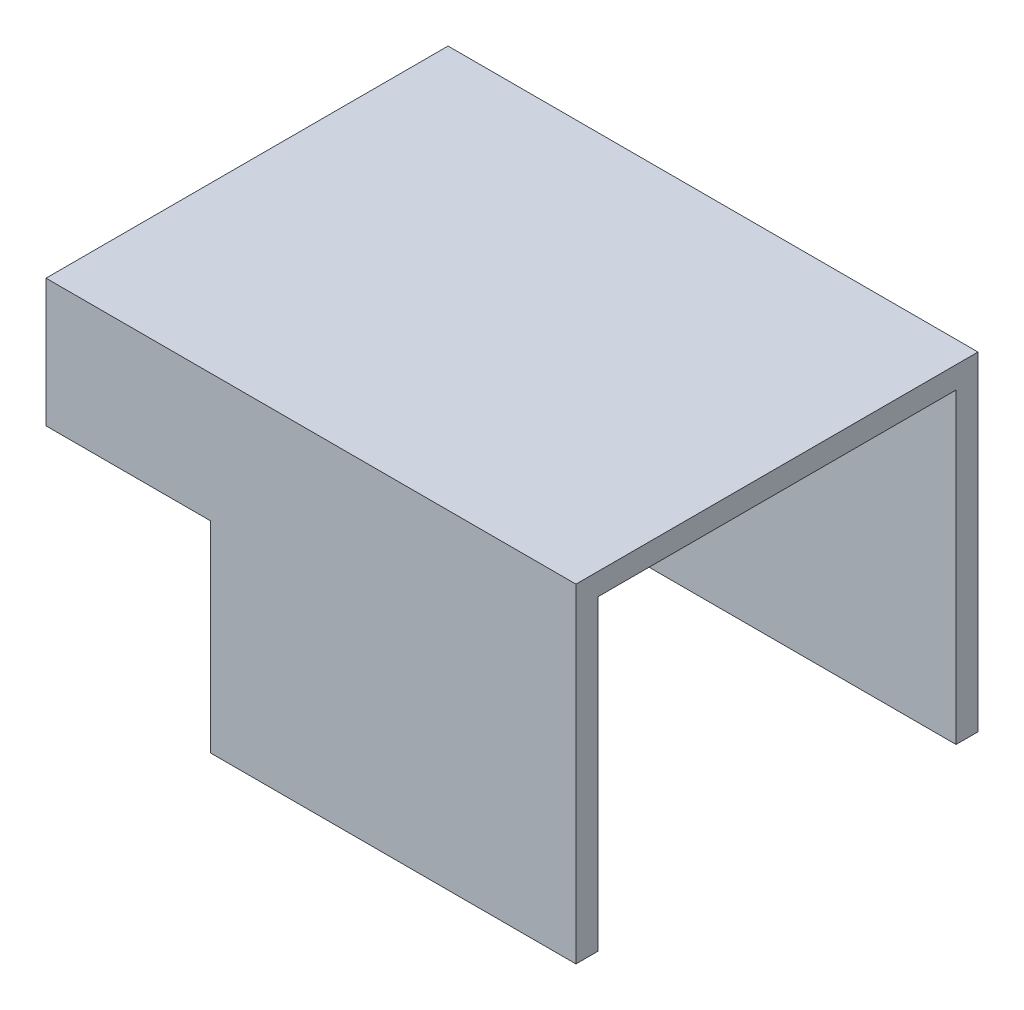
ISO-10303-21;
HEADER;
FILE_DESCRIPTION(('STEP AP214'),'2;1');
FILE_NAME('part.step','',(''),(''),'','','');
FILE_SCHEMA(('AUTOMOTIVE_DESIGN { 1 0 10303 214 1 1 1 1 }'));
ENDSEC;
DATA;
#1=APPLICATION_CONTEXT('core data for automotive mechanical design processes');
#2=APPLICATION_PROTOCOL_DEFINITION('international standard','automotive_design',2000,#1);
#3=PRODUCT_CONTEXT('',#1,'mechanical');
#4=PRODUCT('Part','Part','',(#3));
#5=PRODUCT_RELATED_PRODUCT_CATEGORY('part','',(#4));
#6=PRODUCT_DEFINITION_FORMATION('','',#4);
#7=PRODUCT_DEFINITION_CONTEXT('part definition',#1,'design');
#8=PRODUCT_DEFINITION('design','',#6,#7);
#9=PRODUCT_DEFINITION_SHAPE('','',#8);
#10=(LENGTH_UNIT() NAMED_UNIT(*) SI_UNIT(.MILLI.,.METRE.));
#11=(NAMED_UNIT(*) PLANE_ANGLE_UNIT() SI_UNIT($,.RADIAN.));
#12=(NAMED_UNIT(*) SI_UNIT($,.STERADIAN.) SOLID_ANGLE_UNIT());
#13=UNCERTAINTY_MEASURE_WITH_UNIT(LENGTH_MEASURE(1.E-05),#10,'distance_accuracy_value','');
#14=(GEOMETRIC_REPRESENTATION_CONTEXT(3) GLOBAL_UNCERTAINTY_ASSIGNED_CONTEXT((#13)) GLOBAL_UNIT_ASSIGNED_CONTEXT((#10,
#11,#12)) REPRESENTATION_CONTEXT('',''));
#15=CARTESIAN_POINT('',(0.,0.,0.));
#16=DIRECTION('',(0.,0.,1.));
#17=DIRECTION('',(1.,0.,0.));
#18=AXIS2_PLACEMENT_3D('',#15,#16,#17);
#19=CARTESIAN_POINT('',(0.35,1.695,0.));
#20=DIRECTION('',(0.,1.,0.));
#21=DIRECTION('',(0.707106781186548,0.,0.707106781186548));
#22=AXIS2_PLACEMENT_3D('',#19,#20,#21);
#23=PLANE('',#22);
#24=DIRECTION('',(-1.,0.,0.));
#25=VECTOR('',#24,1.);
#26=CARTESIAN_POINT('',(0.35,1.695,0.03));
#27=LINE('',#26,#25);
#28=CARTESIAN_POINT('',(0.35,1.695,0.03));
#29=VERTEX_POINT('',#28);
#30=CARTESIAN_POINT('',(-0.375,1.695,0.03));
#31=VERTEX_POINT('',#30);
#32=EDGE_CURVE('E34',#29,#31,#27,.T.);
#33=ORIENTED_EDGE('',*,*,#32,.F.);
#34=DIRECTION('',(0.,0.,1.));
#35=VECTOR('',#34,1.);
#36=CARTESIAN_POINT('',(0.35,1.695,0.03));
#37=LINE('',#36,#35);
#38=CARTESIAN_POINT('',(0.35,1.695,0.52));
#39=VERTEX_POINT('',#38);
#40=EDGE_CURVE('E11',#29,#39,#37,.T.);
#41=ORIENTED_EDGE('',*,*,#40,.T.);
#42=DIRECTION('',(-1.,0.,0.));
#43=VECTOR('',#42,1.);
#44=CARTESIAN_POINT('',(0.35,1.695,0.52));
#45=LINE('',#44,#43);
#46=CARTESIAN_POINT('',(-0.375,1.695,0.52));
#47=VERTEX_POINT('',#46);
#48=EDGE_CURVE('E26',#39,#47,#45,.T.);
#49=ORIENTED_EDGE('',*,*,#48,.T.);
#50=DIRECTION('',(0.,0.,1.));
#51=VECTOR('',#50,1.);
#52=CARTESIAN_POINT('',(-0.375,1.695,0.03));
#53=LINE('',#52,#51);
#54=EDGE_CURVE('E145',#31,#47,#53,.T.);
#55=ORIENTED_EDGE('',*,*,#54,.F.);
#56=EDGE_LOOP('',(#33,#41,#49,#55));
#57=FACE_BOUND('',#56,.T.);
#58=ADVANCED_FACE('F16',(#57),#23,.F.);
#59=CARTESIAN_POINT('',(0.,0.,0.03));
#60=DIRECTION('',(0.,0.,1.));
#61=DIRECTION('',(0.707106781186548,0.707106781186548,0.));
#62=AXIS2_PLACEMENT_3D('',#59,#60,#61);
#63=PLANE('',#62);
#64=DIRECTION('',(0.,1.,0.));
#65=VECTOR('',#64,1.);
#66=CARTESIAN_POINT('',(0.35,1.275,0.03));
#67=LINE('',#66,#65);
#68=CARTESIAN_POINT('',(0.35,1.275,0.03));
#69=VERTEX_POINT('',#68);
#70=EDGE_CURVE('E167',#69,#29,#67,.T.);
#71=ORIENTED_EDGE('',*,*,#70,.T.);
#72=ORIENTED_EDGE('',*,*,#32,.T.);
#73=DIRECTION('',(0.,1.,0.));
#74=VECTOR('',#73,1.);
#75=CARTESIAN_POINT('',(-0.375,1.275,0.03));
#76=LINE('',#75,#74);
#77=CARTESIAN_POINT('',(-0.375,1.275,0.03));
#78=VERTEX_POINT('',#77);
#79=EDGE_CURVE('E140',#78,#31,#76,.T.);
#80=ORIENTED_EDGE('',*,*,#79,.F.);
#81=DIRECTION('',(1.,0.,0.));
#82=VECTOR('',#81,1.);
#83=CARTESIAN_POINT('',(-0.375,1.275,0.03));
#84=LINE('',#83,#82);
#85=EDGE_CURVE('E161',#78,#69,#84,.T.);
#86=ORIENTED_EDGE('',*,*,#85,.T.);
#87=EDGE_LOOP('',(#71,#72,#80,#86));
#88=FACE_BOUND('',#87,.T.);
#89=ADVANCED_FACE('F174',(#88),#63,.T.);
#90=CARTESIAN_POINT('',(0.35,1.275,0.));
#91=DIRECTION('',(1.,0.,0.));
#92=DIRECTION('',(0.,0.707106781186548,0.707106781186548));
#93=AXIS2_PLACEMENT_3D('',#90,#91,#92);
#94=PLANE('',#93);
#95=ORIENTED_EDGE('',*,*,#70,.F.);
#96=DIRECTION('',(0.,0.,1.));
#97=VECTOR('',#96,1.);
#98=CARTESIAN_POINT('',(0.35,1.275,0.));
#99=LINE('',#98,#97);
#100=CARTESIAN_POINT('',(0.35,1.275,0.));
#101=VERTEX_POINT('',#100);
#102=EDGE_CURVE('E123',#101,#69,#99,.T.);
#103=ORIENTED_EDGE('',*,*,#102,.F.);
#104=DIRECTION('',(0.,1.,0.));
#105=VECTOR('',#104,1.);
#106=CARTESIAN_POINT('',(0.35,1.275,0.));
#107=LINE('',#106,#105);
#108=CARTESIAN_POINT('',(0.35,1.725,0.));
#109=VERTEX_POINT('',#108);
#110=EDGE_CURVE('E158',#101,#109,#107,.T.);
#111=ORIENTED_EDGE('',*,*,#110,.T.);
#112=DIRECTION('',(0.,0.,1.));
#113=VECTOR('',#112,1.);
#114=CARTESIAN_POINT('',(0.35,1.725,0.));
#115=LINE('',#114,#113);
#116=CARTESIAN_POINT('',(0.35,1.725,0.55));
#117=VERTEX_POINT('',#116);
#118=EDGE_CURVE('E153',#109,#117,#115,.T.);
#119=ORIENTED_EDGE('',*,*,#118,.T.);
#120=DIRECTION('',(0.,1.,0.));
#121=VECTOR('',#120,1.);
#122=CARTESIAN_POINT('',(0.35,1.275,0.55));
#123=LINE('',#122,#121);
#124=CARTESIAN_POINT('',(0.35,1.275,0.55));
#125=VERTEX_POINT('',#124);
#126=EDGE_CURVE('E104',#125,#117,#123,.T.);
#127=ORIENTED_EDGE('',*,*,#126,.F.);
#128=DIRECTION('',(0.,0.,1.));
#129=VECTOR('',#128,1.);
#130=CARTESIAN_POINT('',(0.35,1.275,0.52));
#131=LINE('',#130,#129);
#132=CARTESIAN_POINT('',(0.35,1.275,0.52));
#133=VERTEX_POINT('',#132);
#134=EDGE_CURVE('E101',#133,#125,#131,.T.);
#135=ORIENTED_EDGE('',*,*,#134,.F.);
#136=DIRECTION('',(0.,1.,0.));
#137=VECTOR('',#136,1.);
#138=CARTESIAN_POINT('',(0.35,1.275,0.52));
#139=LINE('',#138,#137);
#140=EDGE_CURVE('E147',#133,#39,#139,.T.);
#141=ORIENTED_EDGE('',*,*,#140,.T.);
#142=ORIENTED_EDGE('',*,*,#40,.F.);
#143=EDGE_LOOP('',(#95,#103,#111,#119,#127,#135,#141,#142));
#144=FACE_BOUND('',#143,.T.);
#145=ADVANCED_FACE('F184',(#144),#94,.T.);
#146=CARTESIAN_POINT('',(0.,0.,0.52));
#147=DIRECTION('',(0.,0.,1.));
#148=DIRECTION('',(0.707106781186548,0.707106781186548,0.));
#149=AXIS2_PLACEMENT_3D('',#146,#147,#148);
#150=PLANE('',#149);
#151=ORIENTED_EDGE('',*,*,#48,.F.);
#152=ORIENTED_EDGE('',*,*,#140,.F.);
#153=DIRECTION('',(1.,0.,0.));
#154=VECTOR('',#153,1.);
#155=CARTESIAN_POINT('',(-0.15,1.275,0.52));
#156=LINE('',#155,#154);
#157=CARTESIAN_POINT('',(-0.15,1.275,0.52));
#158=VERTEX_POINT('',#157);
#159=EDGE_CURVE('E149',#158,#133,#156,.T.);
#160=ORIENTED_EDGE('',*,*,#159,.F.);
#161=DIRECTION('',(0.,-1.,0.));
#162=VECTOR('',#161,1.);
#163=CARTESIAN_POINT('',(-0.15,1.55,0.52));
#164=LINE('',#163,#162);
#165=CARTESIAN_POINT('',(-0.15,1.55,0.52));
#166=VERTEX_POINT('',#165);
#167=EDGE_CURVE('E114',#166,#158,#164,.T.);
#168=ORIENTED_EDGE('',*,*,#167,.F.);
#169=DIRECTION('',(-1.,0.,0.));
#170=VECTOR('',#169,1.);
#171=CARTESIAN_POINT('',(-0.15,1.55,0.52));
#172=LINE('',#171,#170);
#173=CARTESIAN_POINT('',(-0.375,1.55,0.52));
#174=VERTEX_POINT('',#173);
#175=EDGE_CURVE('E143',#166,#174,#172,.T.);
#176=ORIENTED_EDGE('',*,*,#175,.T.);
#177=DIRECTION('',(0.,-1.,0.));
#178=VECTOR('',#177,1.);
#179=CARTESIAN_POINT('',(-0.375,1.695,0.52));
#180=LINE('',#179,#178);
#181=EDGE_CURVE('E135',#47,#174,#180,.T.);
#182=ORIENTED_EDGE('',*,*,#181,.F.);
#183=EDGE_LOOP('',(#151,#152,#160,#168,#176,#182));
#184=FACE_BOUND('',#183,.T.);
#185=ADVANCED_FACE('F189',(#184),#150,.F.);
#186=CARTESIAN_POINT('',(-0.375,0.,0.));
#187=DIRECTION('',(-1.,0.,0.));
#188=DIRECTION('',(0.,0.707106781186548,0.707106781186548));
#189=AXIS2_PLACEMENT_3D('',#186,#187,#188);
#190=PLANE('',#189);
#191=DIRECTION('',(0.,-1.,0.));
#192=VECTOR('',#191,1.);
#193=CARTESIAN_POINT('',(-0.375,1.725,0.));
#194=LINE('',#193,#192);
#195=CARTESIAN_POINT('',(-0.375,1.725,0.));
#196=VERTEX_POINT('',#195);
#197=CARTESIAN_POINT('',(-0.375,1.275,0.));
#198=VERTEX_POINT('',#197);
#199=EDGE_CURVE('E139',#196,#198,#194,.T.);
#200=ORIENTED_EDGE('',*,*,#199,.T.);
#201=DIRECTION('',(0.,0.,1.));
#202=VECTOR('',#201,1.);
#203=CARTESIAN_POINT('',(-0.375,1.275,0.));
#204=LINE('',#203,#202);
#205=EDGE_CURVE('E136',#198,#78,#204,.T.);
#206=ORIENTED_EDGE('',*,*,#205,.T.);
#207=ORIENTED_EDGE('',*,*,#79,.T.);
#208=ORIENTED_EDGE('',*,*,#54,.T.);
#209=ORIENTED_EDGE('',*,*,#181,.T.);
#210=DIRECTION('',(0.,0.,1.));
#211=VECTOR('',#210,1.);
#212=CARTESIAN_POINT('',(-0.375,1.55,0.52));
#213=LINE('',#212,#211);
#214=CARTESIAN_POINT('',(-0.375,1.55,0.55));
#215=VERTEX_POINT('',#214);
#216=EDGE_CURVE('E132',#174,#215,#213,.T.);
#217=ORIENTED_EDGE('',*,*,#216,.T.);
#218=DIRECTION('',(0.,1.,0.));
#219=VECTOR('',#218,1.);
#220=CARTESIAN_POINT('',(-0.375,1.55,0.55));
#221=LINE('',#220,#219);
#222=CARTESIAN_POINT('',(-0.375,1.725,0.55));
#223=VERTEX_POINT('',#222);
#224=EDGE_CURVE('E129',#215,#223,#221,.T.);
#225=ORIENTED_EDGE('',*,*,#224,.T.);
#226=DIRECTION('',(0.,0.,-1.));
#227=VECTOR('',#226,1.);
#228=CARTESIAN_POINT('',(-0.375,1.725,0.55));
#229=LINE('',#228,#227);
#230=EDGE_CURVE('E127',#223,#196,#229,.T.);
#231=ORIENTED_EDGE('',*,*,#230,.T.);
#232=EDGE_LOOP('',(#200,#206,#207,#208,#209,#217,#225,#231));
#233=FACE_BOUND('',#232,.T.);
#234=ADVANCED_FACE('F178',(#233),#190,.T.);
#235=CARTESIAN_POINT('',(-0.15,1.275,0.));
#236=DIRECTION('',(0.,-1.,0.));
#237=DIRECTION('',(0.707106781186548,0.,0.707106781186548));
#238=AXIS2_PLACEMENT_3D('',#235,#236,#237);
#239=PLANE('',#238);
#240=ORIENTED_EDGE('',*,*,#85,.F.);
#241=ORIENTED_EDGE('',*,*,#205,.F.);
#242=DIRECTION('',(1.,0.,0.));
#243=VECTOR('',#242,1.);
#244=CARTESIAN_POINT('',(-0.375,1.275,0.));
#245=LINE('',#244,#243);
#246=EDGE_CURVE('E124',#198,#101,#245,.T.);
#247=ORIENTED_EDGE('',*,*,#246,.T.);
#248=ORIENTED_EDGE('',*,*,#102,.T.);
#249=EDGE_LOOP('',(#240,#241,#247,#248));
#250=FACE_BOUND('',#249,.T.);
#251=ADVANCED_FACE('F182',(#250),#239,.T.);
#252=CARTESIAN_POINT('',(0.,0.,0.));
#253=DIRECTION('',(0.,0.,1.));
#254=DIRECTION('',(0.707106781186548,0.707106781186548,0.));
#255=AXIS2_PLACEMENT_3D('',#252,#253,#254);
#256=PLANE('',#255);
#257=ORIENTED_EDGE('',*,*,#110,.F.);
#258=ORIENTED_EDGE('',*,*,#246,.F.);
#259=ORIENTED_EDGE('',*,*,#199,.F.);
#260=DIRECTION('',(-1.,0.,0.));
#261=VECTOR('',#260,1.);
#262=CARTESIAN_POINT('',(0.35,1.725,0.));
#263=LINE('',#262,#261);
#264=EDGE_CURVE('E120',#109,#196,#263,.T.);
#265=ORIENTED_EDGE('',*,*,#264,.F.);
#266=EDGE_LOOP('',(#257,#258,#259,#265));
#267=FACE_BOUND('',#266,.T.);
#268=ADVANCED_FACE('F213',(#267),#256,.F.);
#269=CARTESIAN_POINT('',(0.35,1.725,0.));
#270=DIRECTION('',(0.,1.,0.));
#271=DIRECTION('',(0.707106781186548,0.,0.707106781186548));
#272=AXIS2_PLACEMENT_3D('',#269,#270,#271);
#273=PLANE('',#272);
#274=ORIENTED_EDGE('',*,*,#264,.T.);
#275=ORIENTED_EDGE('',*,*,#230,.F.);
#276=DIRECTION('',(-1.,0.,0.));
#277=VECTOR('',#276,1.);
#278=CARTESIAN_POINT('',(0.35,1.725,0.55));
#279=LINE('',#278,#277);
#280=EDGE_CURVE('E111',#117,#223,#279,.T.);
#281=ORIENTED_EDGE('',*,*,#280,.F.);
#282=ORIENTED_EDGE('',*,*,#118,.F.);
#283=EDGE_LOOP('',(#274,#275,#281,#282));
#284=FACE_BOUND('',#283,.T.);
#285=ADVANCED_FACE('F216',(#284),#273,.T.);
#286=CARTESIAN_POINT('',(0.,0.,0.55));
#287=DIRECTION('',(0.,0.,1.));
#288=DIRECTION('',(0.707106781186548,0.707106781186548,0.));
#289=AXIS2_PLACEMENT_3D('',#286,#287,#288);
#290=PLANE('',#289);
#291=ORIENTED_EDGE('',*,*,#280,.T.);
#292=ORIENTED_EDGE('',*,*,#224,.F.);
#293=DIRECTION('',(-1.,0.,0.));
#294=VECTOR('',#293,1.);
#295=CARTESIAN_POINT('',(-0.15,1.55,0.55));
#296=LINE('',#295,#294);
#297=CARTESIAN_POINT('',(-0.15,1.55,0.55));
#298=VERTEX_POINT('',#297);
#299=EDGE_CURVE('E90',#298,#215,#296,.T.);
#300=ORIENTED_EDGE('',*,*,#299,.F.);
#301=DIRECTION('',(0.,-1.,0.));
#302=VECTOR('',#301,1.);
#303=CARTESIAN_POINT('',(-0.15,1.55,0.55));
#304=LINE('',#303,#302);
#305=CARTESIAN_POINT('',(-0.15,1.275,0.55));
#306=VERTEX_POINT('',#305);
#307=EDGE_CURVE('E103',#298,#306,#304,.T.);
#308=ORIENTED_EDGE('',*,*,#307,.T.);
#309=DIRECTION('',(1.,0.,0.));
#310=VECTOR('',#309,1.);
#311=CARTESIAN_POINT('',(-0.15,1.275,0.55));
#312=LINE('',#311,#310);
#313=EDGE_CURVE('E96',#306,#125,#312,.T.);
#314=ORIENTED_EDGE('',*,*,#313,.T.);
#315=ORIENTED_EDGE('',*,*,#126,.T.);
#316=EDGE_LOOP('',(#291,#292,#300,#308,#314,#315));
#317=FACE_BOUND('',#316,.T.);
#318=ADVANCED_FACE('F107',(#317),#290,.T.);
#319=CARTESIAN_POINT('',(-0.15,1.275,0.));
#320=DIRECTION('',(0.,-1.,0.));
#321=DIRECTION('',(0.707106781186548,0.,0.707106781186548));
#322=AXIS2_PLACEMENT_3D('',#319,#320,#321);
#323=PLANE('',#322);
#324=ORIENTED_EDGE('',*,*,#159,.T.);
#325=ORIENTED_EDGE('',*,*,#134,.T.);
#326=ORIENTED_EDGE('',*,*,#313,.F.);
#327=DIRECTION('',(0.,0.,1.));
#328=VECTOR('',#327,1.);
#329=CARTESIAN_POINT('',(-0.15,1.275,0.52));
#330=LINE('',#329,#328);
#331=EDGE_CURVE('E100',#158,#306,#330,.T.);
#332=ORIENTED_EDGE('',*,*,#331,.F.);
#333=EDGE_LOOP('',(#324,#325,#326,#332));
#334=FACE_BOUND('',#333,.T.);
#335=ADVANCED_FACE('F98',(#334),#323,.T.);
#336=CARTESIAN_POINT('',(-0.15,1.725,0.));
#337=DIRECTION('',(-1.,0.,0.));
#338=DIRECTION('',(0.,0.707106781186548,0.707106781186548));
#339=AXIS2_PLACEMENT_3D('',#336,#337,#338);
#340=PLANE('',#339);
#341=DIRECTION('',(0.,0.,1.));
#342=VECTOR('',#341,1.);
#343=CARTESIAN_POINT('',(-0.15,1.55,0.52));
#344=LINE('',#343,#342);
#345=EDGE_CURVE('E20',#166,#298,#344,.T.);
#346=ORIENTED_EDGE('',*,*,#345,.F.);
#347=ORIENTED_EDGE('',*,*,#167,.T.);
#348=ORIENTED_EDGE('',*,*,#331,.T.);
#349=ORIENTED_EDGE('',*,*,#307,.F.);
#350=EDGE_LOOP('',(#346,#347,#348,#349));
#351=FACE_BOUND('',#350,.T.);
#352=ADVANCED_FACE('F113',(#351),#340,.T.);
#353=CARTESIAN_POINT('',(-0.15,1.55,0.52));
#354=DIRECTION('',(0.,-1.,0.));
#355=DIRECTION('',(0.707106781186548,0.,0.707106781186548));
#356=AXIS2_PLACEMENT_3D('',#353,#354,#355);
#357=PLANE('',#356);
#358=ORIENTED_EDGE('',*,*,#345,.T.);
#359=ORIENTED_EDGE('',*,*,#299,.T.);
#360=ORIENTED_EDGE('',*,*,#216,.F.);
#361=ORIENTED_EDGE('',*,*,#175,.F.);
#362=EDGE_LOOP('',(#358,#359,#360,#361));
#363=FACE_BOUND('',#362,.T.);
#364=ADVANCED_FACE('F18',(#363),#357,.T.);
#365=CLOSED_SHELL('',(#58,#89,#145,#185,#234,#251,#268,#285,#318,#335,#352,#364));
#366=MANIFOLD_SOLID_BREP('B1',#365);
#367=ADVANCED_BREP_SHAPE_REPRESENTATION('',(#18,#366),#14);
#368=SHAPE_DEFINITION_REPRESENTATION(#9,#367);
ENDSEC;
END-ISO-10303-21;
